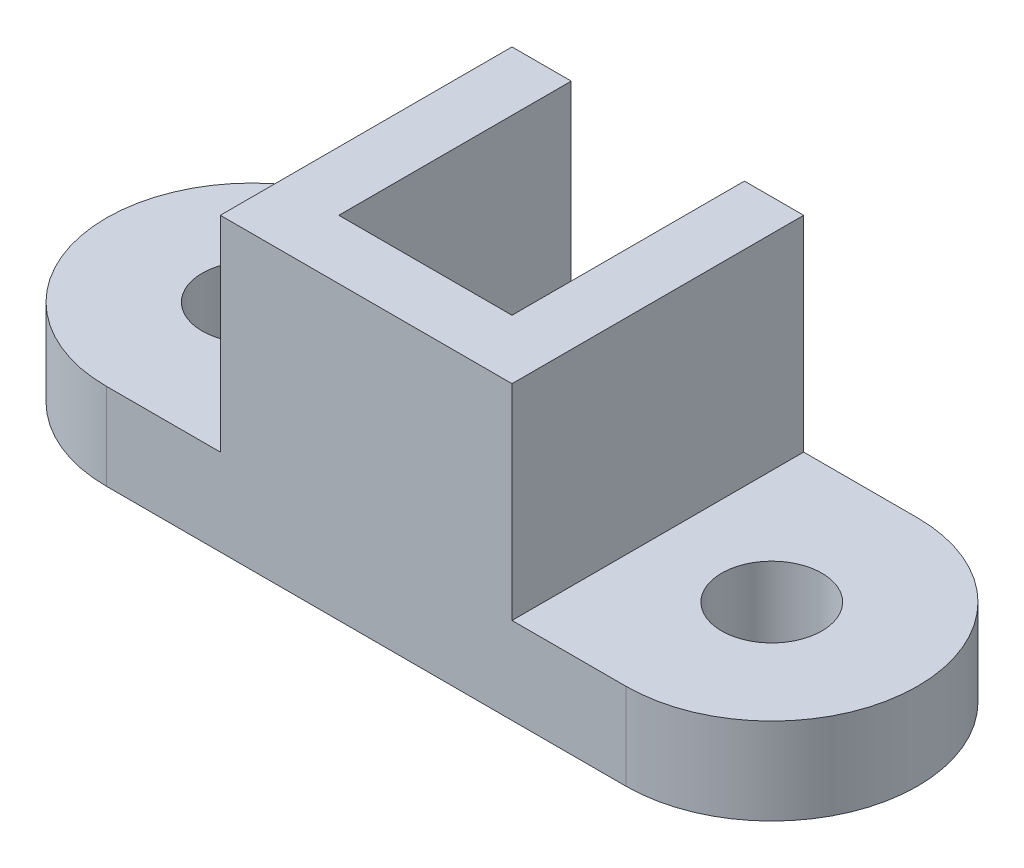
ISO-10303-21;
HEADER;
FILE_DESCRIPTION(('STEP AP214'),'2;1');
FILE_NAME('part.step','',(''),(''),'','','');
FILE_SCHEMA(('AUTOMOTIVE_DESIGN { 1 0 10303 214 1 1 1 1 }'));
ENDSEC;
DATA;
#1=APPLICATION_CONTEXT('core data for automotive mechanical design processes');
#2=APPLICATION_PROTOCOL_DEFINITION('international standard','automotive_design',2000,#1);
#3=PRODUCT_CONTEXT('',#1,'mechanical');
#4=PRODUCT('Part','Part','',(#3));
#5=PRODUCT_RELATED_PRODUCT_CATEGORY('part','',(#4));
#6=PRODUCT_DEFINITION_FORMATION('','',#4);
#7=PRODUCT_DEFINITION_CONTEXT('part definition',#1,'design');
#8=PRODUCT_DEFINITION('design','',#6,#7);
#9=PRODUCT_DEFINITION_SHAPE('','',#8);
#10=(LENGTH_UNIT() NAMED_UNIT(*) SI_UNIT(.MILLI.,.METRE.));
#11=(NAMED_UNIT(*) PLANE_ANGLE_UNIT() SI_UNIT($,.RADIAN.));
#12=(NAMED_UNIT(*) SI_UNIT($,.STERADIAN.) SOLID_ANGLE_UNIT());
#13=UNCERTAINTY_MEASURE_WITH_UNIT(LENGTH_MEASURE(1.E-05),#10,'distance_accuracy_value','');
#14=(GEOMETRIC_REPRESENTATION_CONTEXT(3) GLOBAL_UNCERTAINTY_ASSIGNED_CONTEXT((#13)) GLOBAL_UNIT_ASSIGNED_CONTEXT((#10,
#11,#12)) REPRESENTATION_CONTEXT('',''));
#15=CARTESIAN_POINT('',(0.,0.,0.));
#16=DIRECTION('',(0.,0.,1.));
#17=DIRECTION('',(1.,0.,0.));
#18=AXIS2_PLACEMENT_3D('',#15,#16,#17);
#19=CARTESIAN_POINT('',(-57.,19.,0.));
#20=DIRECTION('',(0.,1.,0.));
#21=DIRECTION('',(0.,0.,1.));
#22=AXIS2_PLACEMENT_3D('',#19,#20,#21);
#23=PLANE('',#22);
#24=DIRECTION('',(0.,0.,1.));
#25=VECTOR('',#24,1.);
#26=CARTESIAN_POINT('',(-32.,19.,32.));
#27=LINE('',#26,#25);
#28=CARTESIAN_POINT('',(-32.,19.,-32.));
#29=VERTEX_POINT('',#28);
#30=CARTESIAN_POINT('',(-32.,19.,32.));
#31=VERTEX_POINT('',#30);
#32=EDGE_CURVE('E62',#29,#31,#27,.T.);
#33=ORIENTED_EDGE('',*,*,#32,.F.);
#34=DIRECTION('',(-1.,0.,0.));
#35=VECTOR('',#34,1.);
#36=CARTESIAN_POINT('',(-57.,19.,-32.));
#37=LINE('',#36,#35);
#38=CARTESIAN_POINT('',(-57.,19.,-32.));
#39=VERTEX_POINT('',#38);
#40=EDGE_CURVE('E196',#29,#39,#37,.T.);
#41=ORIENTED_EDGE('',*,*,#40,.T.);
#42=CARTESIAN_POINT('',(-57.,19.,0.));
#43=DIRECTION('',(0.,1.,0.));
#44=DIRECTION('',(0.,0.,1.));
#45=AXIS2_PLACEMENT_3D('',#42,#43,#44);
#46=CIRCLE('',#45,32.);
#47=CARTESIAN_POINT('',(-57.,19.,32.));
#48=VERTEX_POINT('',#47);
#49=EDGE_CURVE('E187',#39,#48,#46,.T.);
#50=ORIENTED_EDGE('',*,*,#49,.T.);
#51=DIRECTION('',(1.,0.,0.));
#52=VECTOR('',#51,1.);
#53=CARTESIAN_POINT('',(-57.,19.,32.));
#54=LINE('',#53,#52);
#55=EDGE_CURVE('E192',#48,#31,#54,.T.);
#56=ORIENTED_EDGE('',*,*,#55,.T.);
#57=EDGE_LOOP('',(#33,#41,#50,#56));
#58=FACE_BOUND('',#57,.T.);
#59=CARTESIAN_POINT('',(-57.,19.,0.));
#60=DIRECTION('',(0.,1.,0.));
#61=DIRECTION('',(0.,0.,1.));
#62=AXIS2_PLACEMENT_3D('',#59,#60,#61);
#63=CIRCLE('',#62,11.);
#64=CARTESIAN_POINT('',(-57.,19.,11.));
#65=VERTEX_POINT('',#64);
#66=EDGE_CURVE('E181',#65,#65,#63,.T.);
#67=ORIENTED_EDGE('',*,*,#66,.F.);
#68=EDGE_LOOP('',(#67));
#69=FACE_BOUND('',#68,.T.);
#70=ADVANCED_FACE('F39',(#58,#69),#23,.T.);
#71=DIRECTION('',(0.,0.,-1.));
#72=VECTOR('',#71,1.);
#73=CARTESIAN_POINT('',(32.,19.,32.));
#74=LINE('',#73,#72);
#75=CARTESIAN_POINT('',(32.,19.,32.));
#76=VERTEX_POINT('',#75);
#77=CARTESIAN_POINT('',(32.,19.,-32.));
#78=VERTEX_POINT('',#77);
#79=EDGE_CURVE('E152',#76,#78,#74,.T.);
#80=ORIENTED_EDGE('',*,*,#79,.F.);
#81=CARTESIAN_POINT('',(57.,19.,32.));
#82=VERTEX_POINT('',#81);
#83=EDGE_CURVE('E190',#76,#82,#54,.T.);
#84=ORIENTED_EDGE('',*,*,#83,.T.);
#85=CARTESIAN_POINT('',(57.,19.,0.));
#86=DIRECTION('',(0.,1.,0.));
#87=DIRECTION('',(0.,0.,1.));
#88=AXIS2_PLACEMENT_3D('',#85,#86,#87);
#89=CIRCLE('',#88,32.);
#90=CARTESIAN_POINT('',(57.,19.,-32.));
#91=VERTEX_POINT('',#90);
#92=EDGE_CURVE('E194',#82,#91,#89,.T.);
#93=ORIENTED_EDGE('',*,*,#92,.T.);
#94=EDGE_CURVE('E197',#91,#78,#37,.T.);
#95=ORIENTED_EDGE('',*,*,#94,.T.);
#96=EDGE_LOOP('',(#80,#84,#93,#95));
#97=FACE_BOUND('',#96,.T.);
#98=CARTESIAN_POINT('',(57.,19.,0.));
#99=DIRECTION('',(0.,1.,0.));
#100=DIRECTION('',(0.,0.,1.));
#101=AXIS2_PLACEMENT_3D('',#98,#99,#100);
#102=CIRCLE('',#101,11.);
#103=CARTESIAN_POINT('',(57.,19.,11.));
#104=VERTEX_POINT('',#103);
#105=EDGE_CURVE('E175',#104,#104,#102,.T.);
#106=ORIENTED_EDGE('',*,*,#105,.F.);
#107=EDGE_LOOP('',(#106));
#108=FACE_BOUND('',#107,.T.);
#109=ADVANCED_FACE('F246',(#97,#108),#23,.T.);
#110=CARTESIAN_POINT('',(-57.,0.,0.));
#111=DIRECTION('',(0.,1.,0.));
#112=DIRECTION('',(0.,0.,1.));
#113=AXIS2_PLACEMENT_3D('',#110,#111,#112);
#114=PLANE('',#113);
#115=CARTESIAN_POINT('',(-57.,0.,0.));
#116=DIRECTION('',(0.,1.,0.));
#117=DIRECTION('',(0.,0.,1.));
#118=AXIS2_PLACEMENT_3D('',#115,#116,#117);
#119=CIRCLE('',#118,32.);
#120=CARTESIAN_POINT('',(-57.,0.,-32.));
#121=VERTEX_POINT('',#120);
#122=CARTESIAN_POINT('',(-57.,0.,32.));
#123=VERTEX_POINT('',#122);
#124=EDGE_CURVE('E184',#121,#123,#119,.T.);
#125=ORIENTED_EDGE('',*,*,#124,.F.);
#126=DIRECTION('',(-1.,0.,0.));
#127=VECTOR('',#126,1.);
#128=CARTESIAN_POINT('',(-57.,0.,-32.));
#129=LINE('',#128,#127);
#130=CARTESIAN_POINT('',(57.,0.,-32.));
#131=VERTEX_POINT('',#130);
#132=EDGE_CURVE('E191',#131,#121,#129,.T.);
#133=ORIENTED_EDGE('',*,*,#132,.F.);
#134=CARTESIAN_POINT('',(57.,0.,0.));
#135=DIRECTION('',(0.,1.,0.));
#136=DIRECTION('',(0.,0.,1.));
#137=AXIS2_PLACEMENT_3D('',#134,#135,#136);
#138=CIRCLE('',#137,32.);
#139=CARTESIAN_POINT('',(57.,0.,32.));
#140=VERTEX_POINT('',#139);
#141=EDGE_CURVE('E204',#140,#131,#138,.T.);
#142=ORIENTED_EDGE('',*,*,#141,.F.);
#143=DIRECTION('',(1.,0.,0.));
#144=VECTOR('',#143,1.);
#145=CARTESIAN_POINT('',(-57.,0.,32.));
#146=LINE('',#145,#144);
#147=EDGE_CURVE('E202',#123,#140,#146,.T.);
#148=ORIENTED_EDGE('',*,*,#147,.F.);
#149=EDGE_LOOP('',(#125,#133,#142,#148));
#150=FACE_BOUND('',#149,.T.);
#151=CARTESIAN_POINT('',(-57.,0.,0.));
#152=DIRECTION('',(0.,1.,0.));
#153=DIRECTION('',(0.,0.,1.));
#154=AXIS2_PLACEMENT_3D('',#151,#152,#153);
#155=CIRCLE('',#154,11.);
#156=CARTESIAN_POINT('',(-57.,0.,11.));
#157=VERTEX_POINT('',#156);
#158=EDGE_CURVE('E178',#157,#157,#155,.T.);
#159=ORIENTED_EDGE('',*,*,#158,.T.);
#160=EDGE_LOOP('',(#159));
#161=FACE_BOUND('',#160,.T.);
#162=CARTESIAN_POINT('',(57.,0.,0.));
#163=DIRECTION('',(0.,1.,0.));
#164=DIRECTION('',(0.,0.,1.));
#165=AXIS2_PLACEMENT_3D('',#162,#163,#164);
#166=CIRCLE('',#165,11.);
#167=CARTESIAN_POINT('',(57.,0.,11.));
#168=VERTEX_POINT('',#167);
#169=EDGE_CURVE('E174',#168,#168,#166,.T.);
#170=ORIENTED_EDGE('',*,*,#169,.T.);
#171=EDGE_LOOP('',(#170));
#172=FACE_BOUND('',#171,.T.);
#173=ADVANCED_FACE('F223',(#150,#161,#172),#114,.F.);
#174=CARTESIAN_POINT('',(-57.,19.,0.));
#175=DIRECTION('',(0.,-1.,0.));
#176=DIRECTION('',(0.,0.,-1.));
#177=AXIS2_PLACEMENT_3D('',#174,#175,#176);
#178=CYLINDRICAL_SURFACE('',#177,32.);
#179=ORIENTED_EDGE('',*,*,#124,.T.);
#180=DIRECTION('',(0.,-1.,0.));
#181=VECTOR('',#180,1.);
#182=CARTESIAN_POINT('',(-57.,19.,32.));
#183=LINE('',#182,#181);
#184=EDGE_CURVE('E11',#48,#123,#183,.T.);
#185=ORIENTED_EDGE('',*,*,#184,.F.);
#186=ORIENTED_EDGE('',*,*,#49,.F.);
#187=DIRECTION('',(0.,-1.,0.));
#188=VECTOR('',#187,1.);
#189=CARTESIAN_POINT('',(-57.,19.,-32.));
#190=LINE('',#189,#188);
#191=EDGE_CURVE('E199',#39,#121,#190,.T.);
#192=ORIENTED_EDGE('',*,*,#191,.T.);
#193=EDGE_LOOP('',(#179,#185,#186,#192));
#194=FACE_BOUND('',#193,.T.);
#195=ADVANCED_FACE('F41',(#194),#178,.T.);
#196=CARTESIAN_POINT('',(-57.,19.,32.));
#197=DIRECTION('',(0.,0.,-1.));
#198=DIRECTION('',(-1.,0.,0.));
#199=AXIS2_PLACEMENT_3D('',#196,#197,#198);
#200=PLANE('',#199);
#201=ORIENTED_EDGE('',*,*,#147,.T.);
#202=DIRECTION('',(0.,-1.,0.));
#203=VECTOR('',#202,1.);
#204=CARTESIAN_POINT('',(57.,19.,32.));
#205=LINE('',#204,#203);
#206=EDGE_CURVE('E47',#82,#140,#205,.T.);
#207=ORIENTED_EDGE('',*,*,#206,.F.);
#208=ORIENTED_EDGE('',*,*,#83,.F.);
#209=DIRECTION('',(0.,-1.,0.));
#210=VECTOR('',#209,1.);
#211=CARTESIAN_POINT('',(32.,64.,32.));
#212=LINE('',#211,#210);
#213=CARTESIAN_POINT('',(32.,64.,32.));
#214=VERTEX_POINT('',#213);
#215=EDGE_CURVE('E168',#214,#76,#212,.T.);
#216=ORIENTED_EDGE('',*,*,#215,.F.);
#217=DIRECTION('',(1.,0.,0.));
#218=VECTOR('',#217,1.);
#219=CARTESIAN_POINT('',(32.,64.,32.));
#220=LINE('',#219,#218);
#221=CARTESIAN_POINT('',(-32.,64.,32.));
#222=VERTEX_POINT('',#221);
#223=EDGE_CURVE('E151',#222,#214,#220,.T.);
#224=ORIENTED_EDGE('',*,*,#223,.F.);
#225=DIRECTION('',(0.,-1.,0.));
#226=VECTOR('',#225,1.);
#227=CARTESIAN_POINT('',(-32.,64.,32.));
#228=LINE('',#227,#226);
#229=EDGE_CURVE('E171',#222,#31,#228,.T.);
#230=ORIENTED_EDGE('',*,*,#229,.T.);
#231=ORIENTED_EDGE('',*,*,#55,.F.);
#232=ORIENTED_EDGE('',*,*,#184,.T.);
#233=EDGE_LOOP('',(#201,#207,#208,#216,#224,#230,#231,#232));
#234=FACE_BOUND('',#233,.T.);
#235=ADVANCED_FACE('F248',(#234),#200,.F.);
#236=CARTESIAN_POINT('',(57.,19.,0.));
#237=DIRECTION('',(0.,-1.,0.));
#238=DIRECTION('',(0.,0.,-1.));
#239=AXIS2_PLACEMENT_3D('',#236,#237,#238);
#240=CYLINDRICAL_SURFACE('',#239,32.);
#241=ORIENTED_EDGE('',*,*,#141,.T.);
#242=DIRECTION('',(0.,-1.,0.));
#243=VECTOR('',#242,1.);
#244=CARTESIAN_POINT('',(57.,19.,-32.));
#245=LINE('',#244,#243);
#246=EDGE_CURVE('E209',#91,#131,#245,.T.);
#247=ORIENTED_EDGE('',*,*,#246,.F.);
#248=ORIENTED_EDGE('',*,*,#92,.F.);
#249=ORIENTED_EDGE('',*,*,#206,.T.);
#250=EDGE_LOOP('',(#241,#247,#248,#249));
#251=FACE_BOUND('',#250,.T.);
#252=ADVANCED_FACE('F216',(#251),#240,.T.);
#253=CARTESIAN_POINT('',(-57.,19.,-32.));
#254=DIRECTION('',(0.,0.,1.));
#255=DIRECTION('',(1.,0.,0.));
#256=AXIS2_PLACEMENT_3D('',#253,#254,#255);
#257=PLANE('',#256);
#258=DIRECTION('',(-1.,0.,0.));
#259=VECTOR('',#258,1.);
#260=CARTESIAN_POINT('',(32.,64.,-32.));
#261=LINE('',#260,#259);
#262=CARTESIAN_POINT('',(-19.,64.,-32.));
#263=VERTEX_POINT('',#262);
#264=CARTESIAN_POINT('',(-32.,64.,-32.));
#265=VERTEX_POINT('',#264);
#266=EDGE_CURVE('E156',#263,#265,#261,.T.);
#267=ORIENTED_EDGE('',*,*,#266,.F.);
#268=DIRECTION('',(0.,1.,0.));
#269=VECTOR('',#268,1.);
#270=CARTESIAN_POINT('',(-19.,64.,-32.));
#271=LINE('',#270,#269);
#272=CARTESIAN_POINT('',(-19.,13.,-32.));
#273=VERTEX_POINT('',#272);
#274=EDGE_CURVE('E131',#273,#263,#271,.T.);
#275=ORIENTED_EDGE('',*,*,#274,.F.);
#276=DIRECTION('',(1.,0.,0.));
#277=VECTOR('',#276,1.);
#278=CARTESIAN_POINT('',(-19.,13.,-32.));
#279=LINE('',#278,#277);
#280=CARTESIAN_POINT('',(19.,13.,-32.));
#281=VERTEX_POINT('',#280);
#282=EDGE_CURVE('E128',#273,#281,#279,.T.);
#283=ORIENTED_EDGE('',*,*,#282,.T.);
#284=DIRECTION('',(0.,1.,0.));
#285=VECTOR('',#284,1.);
#286=CARTESIAN_POINT('',(19.,64.,-32.));
#287=LINE('',#286,#285);
#288=CARTESIAN_POINT('',(19.,64.,-32.));
#289=VERTEX_POINT('',#288);
#290=EDGE_CURVE('E138',#281,#289,#287,.T.);
#291=ORIENTED_EDGE('',*,*,#290,.T.);
#292=CARTESIAN_POINT('',(32.,64.,-32.));
#293=VERTEX_POINT('',#292);
#294=EDGE_CURVE('E157',#293,#289,#261,.T.);
#295=ORIENTED_EDGE('',*,*,#294,.F.);
#296=DIRECTION('',(0.,-1.,0.));
#297=VECTOR('',#296,1.);
#298=CARTESIAN_POINT('',(32.,64.,-32.));
#299=LINE('',#298,#297);
#300=EDGE_CURVE('E165',#293,#78,#299,.T.);
#301=ORIENTED_EDGE('',*,*,#300,.T.);
#302=ORIENTED_EDGE('',*,*,#94,.F.);
#303=ORIENTED_EDGE('',*,*,#246,.T.);
#304=ORIENTED_EDGE('',*,*,#132,.T.);
#305=ORIENTED_EDGE('',*,*,#191,.F.);
#306=ORIENTED_EDGE('',*,*,#40,.F.);
#307=DIRECTION('',(0.,-1.,0.));
#308=VECTOR('',#307,1.);
#309=CARTESIAN_POINT('',(-32.,64.,-32.));
#310=LINE('',#309,#308);
#311=EDGE_CURVE('E159',#265,#29,#310,.T.);
#312=ORIENTED_EDGE('',*,*,#311,.F.);
#313=EDGE_LOOP('',(#267,#275,#283,#291,#295,#301,#302,#303,#304,#305,#306,#312));
#314=FACE_BOUND('',#313,.T.);
#315=ADVANCED_FACE('F227',(#314),#257,.F.);
#316=CARTESIAN_POINT('',(-57.,19.,0.));
#317=DIRECTION('',(0.,-1.,0.));
#318=DIRECTION('',(0.,0.,-1.));
#319=AXIS2_PLACEMENT_3D('',#316,#317,#318);
#320=CYLINDRICAL_SURFACE('',#319,11.);
#321=ORIENTED_EDGE('',*,*,#66,.T.);
#322=EDGE_LOOP('',(#321));
#323=FACE_BOUND('',#322,.T.);
#324=ORIENTED_EDGE('',*,*,#158,.F.);
#325=EDGE_LOOP('',(#324));
#326=FACE_BOUND('',#325,.T.);
#327=ADVANCED_FACE('F262',(#323,#326),#320,.F.);
#328=CARTESIAN_POINT('',(57.,19.,0.));
#329=DIRECTION('',(0.,-1.,0.));
#330=DIRECTION('',(0.,0.,-1.));
#331=AXIS2_PLACEMENT_3D('',#328,#329,#330);
#332=CYLINDRICAL_SURFACE('',#331,11.);
#333=ORIENTED_EDGE('',*,*,#105,.T.);
#334=EDGE_LOOP('',(#333));
#335=FACE_BOUND('',#334,.T.);
#336=ORIENTED_EDGE('',*,*,#169,.F.);
#337=EDGE_LOOP('',(#336));
#338=FACE_BOUND('',#337,.T.);
#339=ADVANCED_FACE('F270',(#335,#338),#332,.F.);
#340=CARTESIAN_POINT('',(-32.,64.,32.));
#341=DIRECTION('',(1.,0.,0.));
#342=DIRECTION('',(0.,0.,-1.));
#343=AXIS2_PLACEMENT_3D('',#340,#341,#342);
#344=PLANE('',#343);
#345=ORIENTED_EDGE('',*,*,#32,.T.);
#346=ORIENTED_EDGE('',*,*,#229,.F.);
#347=DIRECTION('',(0.,0.,1.));
#348=VECTOR('',#347,1.);
#349=CARTESIAN_POINT('',(-32.,64.,32.));
#350=LINE('',#349,#348);
#351=EDGE_CURVE('E148',#265,#222,#350,.T.);
#352=ORIENTED_EDGE('',*,*,#351,.F.);
#353=ORIENTED_EDGE('',*,*,#311,.T.);
#354=EDGE_LOOP('',(#345,#346,#352,#353));
#355=FACE_BOUND('',#354,.T.);
#356=ADVANCED_FACE('F236',(#355),#344,.F.);
#357=CARTESIAN_POINT('',(32.,64.,32.));
#358=DIRECTION('',(-1.,0.,0.));
#359=DIRECTION('',(0.,0.,1.));
#360=AXIS2_PLACEMENT_3D('',#357,#358,#359);
#361=PLANE('',#360);
#362=ORIENTED_EDGE('',*,*,#79,.T.);
#363=ORIENTED_EDGE('',*,*,#300,.F.);
#364=DIRECTION('',(0.,0.,-1.));
#365=VECTOR('',#364,1.);
#366=CARTESIAN_POINT('',(32.,64.,32.));
#367=LINE('',#366,#365);
#368=EDGE_CURVE('E154',#214,#293,#367,.T.);
#369=ORIENTED_EDGE('',*,*,#368,.F.);
#370=ORIENTED_EDGE('',*,*,#215,.T.);
#371=EDGE_LOOP('',(#362,#363,#369,#370));
#372=FACE_BOUND('',#371,.T.);
#373=ADVANCED_FACE('F244',(#372),#361,.F.);
#374=CARTESIAN_POINT('',(0.,64.,0.));
#375=DIRECTION('',(0.,1.,0.));
#376=DIRECTION('',(0.,0.,1.));
#377=AXIS2_PLACEMENT_3D('',#374,#375,#376);
#378=PLANE('',#377);
#379=DIRECTION('',(0.,0.,1.));
#380=VECTOR('',#379,1.);
#381=CARTESIAN_POINT('',(-19.,64.,19.));
#382=LINE('',#381,#380);
#383=CARTESIAN_POINT('',(-19.,64.,19.));
#384=VERTEX_POINT('',#383);
#385=EDGE_CURVE('E132',#263,#384,#382,.T.);
#386=ORIENTED_EDGE('',*,*,#385,.F.);
#387=ORIENTED_EDGE('',*,*,#266,.T.);
#388=ORIENTED_EDGE('',*,*,#351,.T.);
#389=ORIENTED_EDGE('',*,*,#223,.T.);
#390=ORIENTED_EDGE('',*,*,#368,.T.);
#391=ORIENTED_EDGE('',*,*,#294,.T.);
#392=DIRECTION('',(0.,0.,1.));
#393=VECTOR('',#392,1.);
#394=CARTESIAN_POINT('',(19.,64.,19.));
#395=LINE('',#394,#393);
#396=CARTESIAN_POINT('',(19.,64.,19.));
#397=VERTEX_POINT('',#396);
#398=EDGE_CURVE('E142',#289,#397,#395,.T.);
#399=ORIENTED_EDGE('',*,*,#398,.T.);
#400=DIRECTION('',(1.,0.,0.));
#401=VECTOR('',#400,1.);
#402=CARTESIAN_POINT('',(-19.,64.,19.));
#403=LINE('',#402,#401);
#404=EDGE_CURVE('E125',#384,#397,#403,.T.);
#405=ORIENTED_EDGE('',*,*,#404,.F.);
#406=EDGE_LOOP('',(#386,#387,#388,#389,#390,#391,#399,#405));
#407=FACE_BOUND('',#406,.T.);
#408=ADVANCED_FACE('F140',(#407),#378,.T.);
#409=CARTESIAN_POINT('',(-19.,64.,19.));
#410=DIRECTION('',(0.,-0.707106781186548,0.707106781186547));
#411=DIRECTION('',(0.,-0.707106781186547,-0.707106781186548));
#412=AXIS2_PLACEMENT_3D('',#409,#410,#411);
#413=PLANE('',#412);
#414=DIRECTION('',(0.,-0.707106781186547,-0.707106781186548));
#415=VECTOR('',#414,1.);
#416=CARTESIAN_POINT('',(19.,64.,19.));
#417=LINE('',#416,#415);
#418=EDGE_CURVE('E54',#397,#281,#417,.T.);
#419=ORIENTED_EDGE('',*,*,#418,.T.);
#420=ORIENTED_EDGE('',*,*,#282,.F.);
#421=DIRECTION('',(0.,-0.707106781186547,-0.707106781186548));
#422=VECTOR('',#421,1.);
#423=CARTESIAN_POINT('',(-19.,64.,19.));
#424=LINE('',#423,#422);
#425=EDGE_CURVE('E121',#384,#273,#424,.T.);
#426=ORIENTED_EDGE('',*,*,#425,.F.);
#427=ORIENTED_EDGE('',*,*,#404,.T.);
#428=EDGE_LOOP('',(#419,#420,#426,#427));
#429=FACE_BOUND('',#428,.T.);
#430=ADVANCED_FACE('F123',(#429),#413,.F.);
#431=CARTESIAN_POINT('',(-19.,0.,0.));
#432=DIRECTION('',(-1.,0.,0.));
#433=DIRECTION('',(0.,0.,1.));
#434=AXIS2_PLACEMENT_3D('',#431,#432,#433);
#435=PLANE('',#434);
#436=ORIENTED_EDGE('',*,*,#385,.T.);
#437=ORIENTED_EDGE('',*,*,#425,.T.);
#438=ORIENTED_EDGE('',*,*,#274,.T.);
#439=EDGE_LOOP('',(#436,#437,#438));
#440=FACE_BOUND('',#439,.T.);
#441=ADVANCED_FACE('F135',(#440),#435,.F.);
#442=CARTESIAN_POINT('',(19.,0.,0.));
#443=DIRECTION('',(-1.,0.,0.));
#444=DIRECTION('',(0.,0.,1.));
#445=AXIS2_PLACEMENT_3D('',#442,#443,#444);
#446=PLANE('',#445);
#447=ORIENTED_EDGE('',*,*,#398,.F.);
#448=ORIENTED_EDGE('',*,*,#290,.F.);
#449=ORIENTED_EDGE('',*,*,#418,.F.);
#450=EDGE_LOOP('',(#447,#448,#449));
#451=FACE_BOUND('',#450,.T.);
#452=ADVANCED_FACE('F293',(#451),#446,.T.);
#453=CLOSED_SHELL('',(#70,#109,#173,#195,#235,#252,#315,#327,#339,#356,#373,#408,#430,#441,#452));
#454=MANIFOLD_SOLID_BREP('B2',#453);
#455=ADVANCED_BREP_SHAPE_REPRESENTATION('',(#18,#454),#14);
#456=SHAPE_DEFINITION_REPRESENTATION(#9,#455);
ENDSEC;
END-ISO-10303-21;
